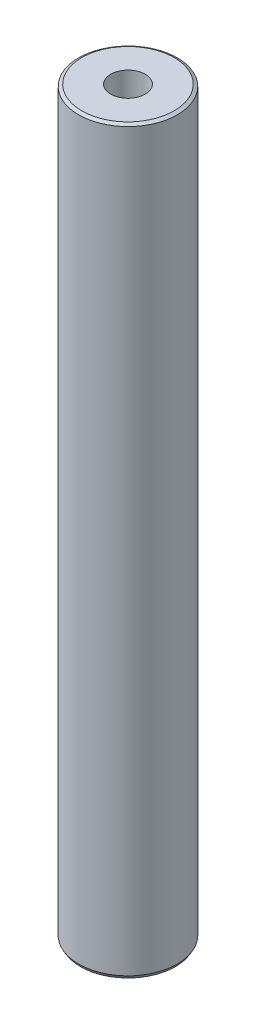
ISO-10303-21;
HEADER;
FILE_DESCRIPTION(('STEP AP214'),'2;1');
FILE_NAME('part.step','',(''),(''),'','','');
FILE_SCHEMA(('AUTOMOTIVE_DESIGN { 1 0 10303 214 1 1 1 1 }'));
ENDSEC;
DATA;
#1=APPLICATION_CONTEXT('core data for automotive mechanical design processes');
#2=APPLICATION_PROTOCOL_DEFINITION('international standard','automotive_design',2000,#1);
#3=PRODUCT_CONTEXT('',#1,'mechanical');
#4=PRODUCT('Part','Part','',(#3));
#5=PRODUCT_RELATED_PRODUCT_CATEGORY('part','',(#4));
#6=PRODUCT_DEFINITION_FORMATION('','',#4);
#7=PRODUCT_DEFINITION_CONTEXT('part definition',#1,'design');
#8=PRODUCT_DEFINITION('design','',#6,#7);
#9=PRODUCT_DEFINITION_SHAPE('','',#8);
#10=(LENGTH_UNIT() NAMED_UNIT(*) SI_UNIT(.MILLI.,.METRE.));
#11=(NAMED_UNIT(*) PLANE_ANGLE_UNIT() SI_UNIT($,.RADIAN.));
#12=(NAMED_UNIT(*) SI_UNIT($,.STERADIAN.) SOLID_ANGLE_UNIT());
#13=UNCERTAINTY_MEASURE_WITH_UNIT(LENGTH_MEASURE(1.E-05),#10,'distance_accuracy_value','');
#14=(GEOMETRIC_REPRESENTATION_CONTEXT(3) GLOBAL_UNCERTAINTY_ASSIGNED_CONTEXT((#13)) GLOBAL_UNIT_ASSIGNED_CONTEXT((#10,
#11,#12)) REPRESENTATION_CONTEXT('',''));
#15=CARTESIAN_POINT('',(0.,0.,0.));
#16=DIRECTION('',(0.,0.,1.));
#17=DIRECTION('',(1.,0.,0.));
#18=AXIS2_PLACEMENT_3D('',#15,#16,#17);
#19=CARTESIAN_POINT('',(0.,600.,0.));
#20=DIRECTION('',(0.,-1.,0.));
#21=DIRECTION('',(0.,0.,-1.));
#22=AXIS2_PLACEMENT_3D('',#19,#20,#21);
#23=CYLINDRICAL_SURFACE('',#22,40.);
#24=CARTESIAN_POINT('',(0.,598.513866774643,0.));
#25=DIRECTION('',(0.,1.,0.));
#26=DIRECTION('',(0.,0.,1.));
#27=AXIS2_PLACEMENT_3D('',#24,#25,#26);
#28=CIRCLE('',#27,40.);
#29=CARTESIAN_POINT('',(0.,598.513866774643,40.));
#30=VERTEX_POINT('',#29);
#31=EDGE_CURVE('E50',#30,#30,#28,.F.);
#32=ORIENTED_EDGE('',*,*,#31,.T.);
#33=EDGE_LOOP('',(#32));
#34=FACE_BOUND('',#33,.T.);
#35=CARTESIAN_POINT('',(0.,2.57405825313495,0.));
#36=DIRECTION('',(0.,1.,0.));
#37=DIRECTION('',(0.,0.,1.));
#38=AXIS2_PLACEMENT_3D('',#35,#36,#37);
#39=CIRCLE('',#38,40.);
#40=CARTESIAN_POINT('',(0.,2.57405825313495,40.));
#41=VERTEX_POINT('',#40);
#42=EDGE_CURVE('E51',#41,#41,#39,.T.);
#43=ORIENTED_EDGE('',*,*,#42,.T.);
#44=EDGE_LOOP('',(#43));
#45=FACE_BOUND('',#44,.T.);
#46=ADVANCED_FACE('F39',(#34,#45),#23,.T.);
#47=CARTESIAN_POINT('',(0.,600.,0.));
#48=DIRECTION('',(0.,1.,0.));
#49=DIRECTION('',(0.,0.,1.));
#50=AXIS2_PLACEMENT_3D('',#47,#48,#49);
#51=PLANE('',#50);
#52=CARTESIAN_POINT('',(0.,600.,0.));
#53=DIRECTION('',(0.,1.,0.));
#54=DIRECTION('',(0.,0.,1.));
#55=AXIS2_PLACEMENT_3D('',#52,#53,#54);
#56=CIRCLE('',#55,37.4259417468653);
#57=CARTESIAN_POINT('',(0.,600.,37.4259417468653));
#58=VERTEX_POINT('',#57);
#59=EDGE_CURVE('E54',#58,#58,#56,.T.);
#60=ORIENTED_EDGE('',*,*,#59,.T.);
#61=EDGE_LOOP('',(#60));
#62=FACE_BOUND('',#61,.T.);
#63=CARTESIAN_POINT('',(0.,600.,0.));
#64=DIRECTION('',(0.,1.,0.));
#65=DIRECTION('',(0.,0.,1.));
#66=AXIS2_PLACEMENT_3D('',#63,#64,#65);
#67=CIRCLE('',#66,13.9997325705108);
#68=CARTESIAN_POINT('',(0.,600.,13.9997325705108));
#69=VERTEX_POINT('',#68);
#70=EDGE_CURVE('E58',#69,#69,#67,.T.);
#71=ORIENTED_EDGE('',*,*,#70,.F.);
#72=EDGE_LOOP('',(#71));
#73=FACE_BOUND('',#72,.T.);
#74=ADVANCED_FACE('F69',(#62,#73),#51,.T.);
#75=CARTESIAN_POINT('',(0.,0.,0.));
#76=DIRECTION('',(0.,1.,0.));
#77=DIRECTION('',(0.,0.,1.));
#78=AXIS2_PLACEMENT_3D('',#75,#76,#77);
#79=PLANE('',#78);
#80=CARTESIAN_POINT('',(0.,0.,0.));
#81=DIRECTION('',(0.,1.,0.));
#82=DIRECTION('',(0.,0.,1.));
#83=AXIS2_PLACEMENT_3D('',#80,#81,#82);
#84=CIRCLE('',#83,38.5138667746428);
#85=CARTESIAN_POINT('',(0.,0.,38.5138667746428));
#86=VERTEX_POINT('',#85);
#87=EDGE_CURVE('E10',#86,#86,#84,.F.);
#88=ORIENTED_EDGE('',*,*,#87,.T.);
#89=EDGE_LOOP('',(#88));
#90=FACE_BOUND('',#89,.T.);
#91=CARTESIAN_POINT('',(0.,0.,0.));
#92=DIRECTION('',(0.,1.,0.));
#93=DIRECTION('',(0.,0.,1.));
#94=AXIS2_PLACEMENT_3D('',#91,#92,#93);
#95=CIRCLE('',#94,13.9997325705108);
#96=CARTESIAN_POINT('',(0.,0.,13.9997325705108));
#97=VERTEX_POINT('',#96);
#98=EDGE_CURVE('E63',#97,#97,#95,.T.);
#99=ORIENTED_EDGE('',*,*,#98,.T.);
#100=EDGE_LOOP('',(#99));
#101=FACE_BOUND('',#100,.T.);
#102=ADVANCED_FACE('F75',(#90,#101),#79,.F.);
#103=CARTESIAN_POINT('',(0.,600.,0.));
#104=DIRECTION('',(0.,-1.,0.));
#105=DIRECTION('',(0.,0.,-1.));
#106=AXIS2_PLACEMENT_3D('',#103,#104,#105);
#107=CYLINDRICAL_SURFACE('',#106,13.9997325705108);
#108=ORIENTED_EDGE('',*,*,#70,.T.);
#109=EDGE_LOOP('',(#108));
#110=FACE_BOUND('',#109,.T.);
#111=ORIENTED_EDGE('',*,*,#98,.F.);
#112=EDGE_LOOP('',(#111));
#113=FACE_BOUND('',#112,.T.);
#114=ADVANCED_FACE('F70',(#110,#113),#107,.F.);
#115=CARTESIAN_POINT('',(0.,600.,0.));
#116=DIRECTION('',(0.,-1.,0.));
#117=DIRECTION('',(0.,0.,-1.));
#118=AXIS2_PLACEMENT_3D('',#115,#116,#117);
#119=CONICAL_SURFACE('',#118,37.4259417468653,1.0471975511966);
#120=ORIENTED_EDGE('',*,*,#31,.F.);
#121=EDGE_LOOP('',(#120));
#122=FACE_BOUND('',#121,.T.);
#123=ORIENTED_EDGE('',*,*,#59,.F.);
#124=EDGE_LOOP('',(#123));
#125=FACE_BOUND('',#124,.T.);
#126=ADVANCED_FACE('F81',(#122,#125),#119,.T.);
#127=CARTESIAN_POINT('',(0.,2.57405825313495,0.));
#128=DIRECTION('',(0.,1.,0.));
#129=DIRECTION('',(0.,0.,1.));
#130=AXIS2_PLACEMENT_3D('',#127,#128,#129);
#131=CONICAL_SURFACE('',#130,40.,0.523598775598303);
#132=ORIENTED_EDGE('',*,*,#87,.F.);
#133=EDGE_LOOP('',(#132));
#134=FACE_BOUND('',#133,.T.);
#135=ORIENTED_EDGE('',*,*,#42,.F.);
#136=EDGE_LOOP('',(#135));
#137=FACE_BOUND('',#136,.T.);
#138=ADVANCED_FACE('F45',(#134,#137),#131,.T.);
#139=CLOSED_SHELL('',(#46,#74,#102,#114,#126,#138));
#140=MANIFOLD_SOLID_BREP('B2',#139);
#141=ADVANCED_BREP_SHAPE_REPRESENTATION('',(#18,#140),#14);
#142=SHAPE_DEFINITION_REPRESENTATION(#9,#141);
ENDSEC;
END-ISO-10303-21;
